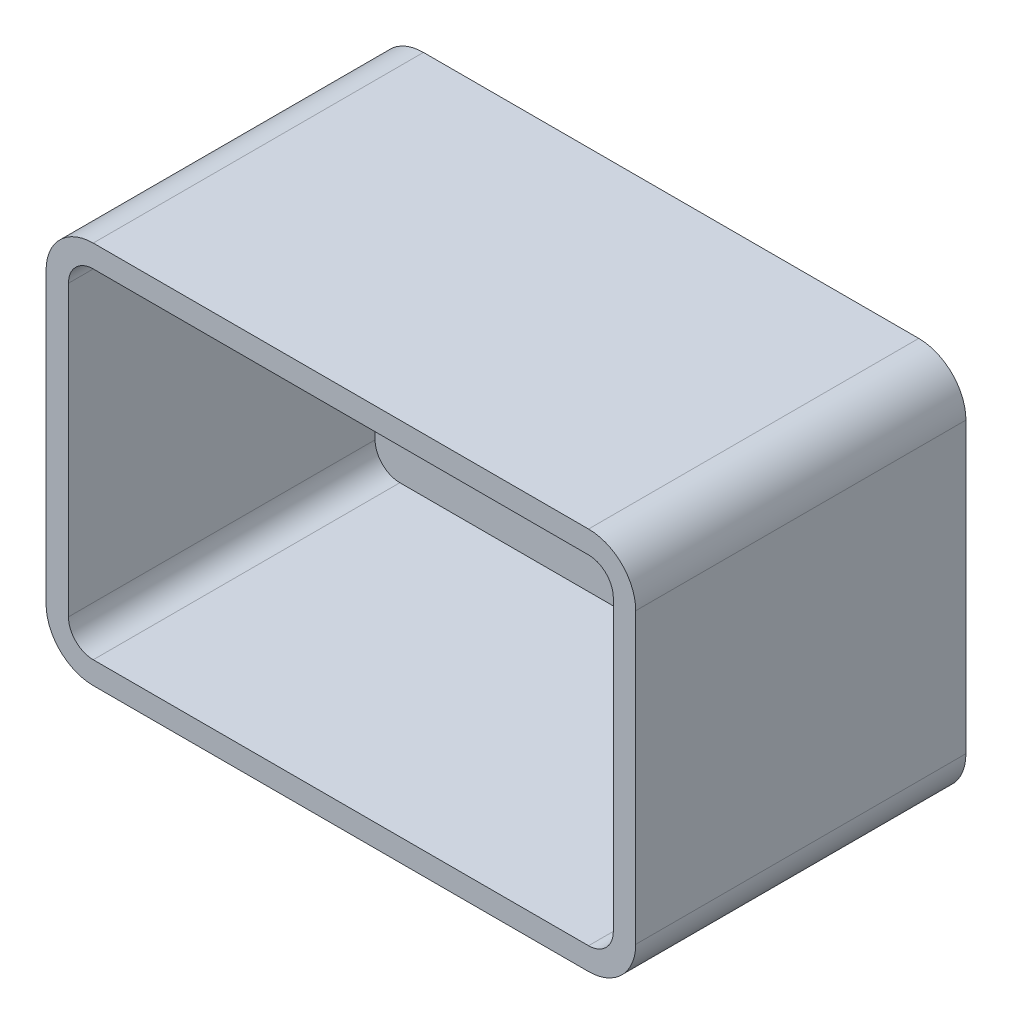
ISO-10303-21;
HEADER;
FILE_DESCRIPTION(('STEP AP214'),'2;1');
FILE_NAME('part.step','',(''),(''),'','','');
FILE_SCHEMA(('AUTOMOTIVE_DESIGN { 1 0 10303 214 1 1 1 1 }'));
ENDSEC;
DATA;
#1=APPLICATION_CONTEXT('core data for automotive mechanical design processes');
#2=APPLICATION_PROTOCOL_DEFINITION('international standard','automotive_design',2000,#1);
#3=PRODUCT_CONTEXT('',#1,'mechanical');
#4=PRODUCT('Part','Part','',(#3));
#5=PRODUCT_RELATED_PRODUCT_CATEGORY('part','',(#4));
#6=PRODUCT_DEFINITION_FORMATION('','',#4);
#7=PRODUCT_DEFINITION_CONTEXT('part definition',#1,'design');
#8=PRODUCT_DEFINITION('design','',#6,#7);
#9=PRODUCT_DEFINITION_SHAPE('','',#8);
#10=(LENGTH_UNIT() NAMED_UNIT(*) SI_UNIT(.MILLI.,.METRE.));
#11=(NAMED_UNIT(*) PLANE_ANGLE_UNIT() SI_UNIT($,.RADIAN.));
#12=(NAMED_UNIT(*) SI_UNIT($,.STERADIAN.) SOLID_ANGLE_UNIT());
#13=UNCERTAINTY_MEASURE_WITH_UNIT(LENGTH_MEASURE(1.E-05),#10,'distance_accuracy_value','');
#14=(GEOMETRIC_REPRESENTATION_CONTEXT(3) GLOBAL_UNCERTAINTY_ASSIGNED_CONTEXT((#13)) GLOBAL_UNIT_ASSIGNED_CONTEXT((#10,
#11,#12)) REPRESENTATION_CONTEXT('',''));
#15=CARTESIAN_POINT('',(0.,0.,0.));
#16=DIRECTION('',(0.,0.,1.));
#17=DIRECTION('',(1.,0.,0.));
#18=AXIS2_PLACEMENT_3D('',#15,#16,#17);
#19=CARTESIAN_POINT('',(-23.1,0.,28.));
#20=DIRECTION('',(-1.,0.,0.));
#21=DIRECTION('',(0.,0.,1.));
#22=AXIS2_PLACEMENT_3D('',#19,#20,#21);
#23=PLANE('',#22);
#24=DIRECTION('',(0.,0.,-1.));
#25=VECTOR('',#24,1.);
#26=CARTESIAN_POINT('',(-23.1,-12.25,28.));
#27=LINE('',#26,#25);
#28=CARTESIAN_POINT('',(-23.1,-12.25,28.));
#29=VERTEX_POINT('',#28);
#30=CARTESIAN_POINT('',(-23.1,-12.25,2.));
#31=VERTEX_POINT('',#30);
#32=EDGE_CURVE('E212',#29,#31,#27,.T.);
#33=ORIENTED_EDGE('',*,*,#32,.T.);
#34=DIRECTION('',(0.,1.,0.));
#35=VECTOR('',#34,1.);
#36=CARTESIAN_POINT('',(-23.1,0.,2.));
#37=LINE('',#36,#35);
#38=CARTESIAN_POINT('',(-23.1,12.25,2.));
#39=VERTEX_POINT('',#38);
#40=EDGE_CURVE('E58',#31,#39,#37,.T.);
#41=ORIENTED_EDGE('',*,*,#40,.T.);
#42=DIRECTION('',(0.,0.,-1.));
#43=VECTOR('',#42,1.);
#44=CARTESIAN_POINT('',(-23.1,12.25,28.));
#45=LINE('',#44,#43);
#46=CARTESIAN_POINT('',(-23.1,12.25,28.));
#47=VERTEX_POINT('',#46);
#48=EDGE_CURVE('E11',#47,#39,#45,.T.);
#49=ORIENTED_EDGE('',*,*,#48,.F.);
#50=DIRECTION('',(0.,1.,0.));
#51=VECTOR('',#50,1.);
#52=CARTESIAN_POINT('',(-23.1,0.,28.));
#53=LINE('',#52,#51);
#54=EDGE_CURVE('E302',#29,#47,#53,.T.);
#55=ORIENTED_EDGE('',*,*,#54,.F.);
#56=EDGE_LOOP('',(#33,#41,#49,#55));
#57=FACE_BOUND('',#56,.T.);
#58=ADVANCED_FACE('F40',(#57),#23,.F.);
#59=CARTESIAN_POINT('',(-21.,12.25,28.));
#60=DIRECTION('',(0.,0.,-1.));
#61=DIRECTION('',(-1.,0.,0.));
#62=AXIS2_PLACEMENT_3D('',#59,#60,#61);
#63=CYLINDRICAL_SURFACE('',#62,2.1);
#64=ORIENTED_EDGE('',*,*,#48,.T.);
#65=CARTESIAN_POINT('',(-21.,12.25,2.));
#66=DIRECTION('',(0.,0.,1.));
#67=DIRECTION('',(1.,0.,0.));
#68=AXIS2_PLACEMENT_3D('',#65,#66,#67);
#69=CIRCLE('',#68,2.1);
#70=CARTESIAN_POINT('',(-21.,14.35,2.));
#71=VERTEX_POINT('',#70);
#72=EDGE_CURVE('E389',#39,#71,#69,.F.);
#73=ORIENTED_EDGE('',*,*,#72,.T.);
#74=DIRECTION('',(0.,0.,-1.));
#75=VECTOR('',#74,1.);
#76=CARTESIAN_POINT('',(-21.,14.35,28.));
#77=LINE('',#76,#75);
#78=CARTESIAN_POINT('',(-21.,14.35,28.));
#79=VERTEX_POINT('',#78);
#80=EDGE_CURVE('E50',#79,#71,#77,.T.);
#81=ORIENTED_EDGE('',*,*,#80,.F.);
#82=CARTESIAN_POINT('',(-21.,12.25,28.));
#83=DIRECTION('',(0.,0.,1.));
#84=DIRECTION('',(1.,0.,0.));
#85=AXIS2_PLACEMENT_3D('',#82,#83,#84);
#86=CIRCLE('',#85,2.1);
#87=EDGE_CURVE('E305',#47,#79,#86,.F.);
#88=ORIENTED_EDGE('',*,*,#87,.F.);
#89=EDGE_LOOP('',(#64,#73,#81,#88));
#90=FACE_BOUND('',#89,.T.);
#91=ADVANCED_FACE('F407',(#90),#63,.F.);
#92=CARTESIAN_POINT('',(0.,14.35,28.));
#93=DIRECTION('',(0.,1.,0.));
#94=DIRECTION('',(0.,0.,1.));
#95=AXIS2_PLACEMENT_3D('',#92,#93,#94);
#96=PLANE('',#95);
#97=ORIENTED_EDGE('',*,*,#80,.T.);
#98=DIRECTION('',(1.,0.,0.));
#99=VECTOR('',#98,1.);
#100=CARTESIAN_POINT('',(0.,14.35,2.));
#101=LINE('',#100,#99);
#102=CARTESIAN_POINT('',(21.,14.35,2.));
#103=VERTEX_POINT('',#102);
#104=EDGE_CURVE('E412',#71,#103,#101,.T.);
#105=ORIENTED_EDGE('',*,*,#104,.T.);
#106=DIRECTION('',(0.,0.,-1.));
#107=VECTOR('',#106,1.);
#108=CARTESIAN_POINT('',(21.,14.35,28.));
#109=LINE('',#108,#107);
#110=CARTESIAN_POINT('',(21.,14.35,28.));
#111=VERTEX_POINT('',#110);
#112=EDGE_CURVE('E224',#111,#103,#109,.T.);
#113=ORIENTED_EDGE('',*,*,#112,.F.);
#114=DIRECTION('',(1.,0.,0.));
#115=VECTOR('',#114,1.);
#116=CARTESIAN_POINT('',(0.,14.35,28.));
#117=LINE('',#116,#115);
#118=EDGE_CURVE('E308',#79,#111,#117,.T.);
#119=ORIENTED_EDGE('',*,*,#118,.F.);
#120=EDGE_LOOP('',(#97,#105,#113,#119));
#121=FACE_BOUND('',#120,.T.);
#122=ADVANCED_FACE('F410',(#121),#96,.F.);
#123=CARTESIAN_POINT('',(21.,12.25,28.));
#124=DIRECTION('',(0.,0.,-1.));
#125=DIRECTION('',(-1.,0.,0.));
#126=AXIS2_PLACEMENT_3D('',#123,#124,#125);
#127=CYLINDRICAL_SURFACE('',#126,2.1);
#128=ORIENTED_EDGE('',*,*,#112,.T.);
#129=CARTESIAN_POINT('',(21.,12.25,2.));
#130=DIRECTION('',(0.,0.,1.));
#131=DIRECTION('',(1.,0.,0.));
#132=AXIS2_PLACEMENT_3D('',#129,#130,#131);
#133=CIRCLE('',#132,2.1);
#134=CARTESIAN_POINT('',(23.1,12.25,2.));
#135=VERTEX_POINT('',#134);
#136=EDGE_CURVE('E416',#103,#135,#133,.F.);
#137=ORIENTED_EDGE('',*,*,#136,.T.);
#138=DIRECTION('',(0.,0.,-1.));
#139=VECTOR('',#138,1.);
#140=CARTESIAN_POINT('',(23.1,12.25,28.));
#141=LINE('',#140,#139);
#142=CARTESIAN_POINT('',(23.1,12.25,28.));
#143=VERTEX_POINT('',#142);
#144=EDGE_CURVE('E220',#143,#135,#141,.T.);
#145=ORIENTED_EDGE('',*,*,#144,.F.);
#146=CARTESIAN_POINT('',(21.,12.25,28.));
#147=DIRECTION('',(0.,0.,1.));
#148=DIRECTION('',(1.,0.,0.));
#149=AXIS2_PLACEMENT_3D('',#146,#147,#148);
#150=CIRCLE('',#149,2.1);
#151=EDGE_CURVE('E311',#111,#143,#150,.F.);
#152=ORIENTED_EDGE('',*,*,#151,.F.);
#153=EDGE_LOOP('',(#128,#137,#145,#152));
#154=FACE_BOUND('',#153,.T.);
#155=ADVANCED_FACE('F415',(#154),#127,.F.);
#156=CARTESIAN_POINT('',(23.1,0.,28.));
#157=DIRECTION('',(-1.,0.,0.));
#158=DIRECTION('',(0.,0.,1.));
#159=AXIS2_PLACEMENT_3D('',#156,#157,#158);
#160=PLANE('',#159);
#161=DIRECTION('',(0.,1.,0.));
#162=VECTOR('',#161,1.);
#163=CARTESIAN_POINT('',(23.1,0.,2.));
#164=LINE('',#163,#162);
#165=CARTESIAN_POINT('',(23.1,-12.25,2.));
#166=VERTEX_POINT('',#165);
#167=EDGE_CURVE('E322',#166,#135,#164,.T.);
#168=ORIENTED_EDGE('',*,*,#167,.F.);
#169=DIRECTION('',(0.,0.,-1.));
#170=VECTOR('',#169,1.);
#171=CARTESIAN_POINT('',(23.1,-12.25,28.));
#172=LINE('',#171,#170);
#173=CARTESIAN_POINT('',(23.1,-12.25,28.));
#174=VERTEX_POINT('',#173);
#175=EDGE_CURVE('E162',#174,#166,#172,.T.);
#176=ORIENTED_EDGE('',*,*,#175,.F.);
#177=DIRECTION('',(0.,1.,0.));
#178=VECTOR('',#177,1.);
#179=CARTESIAN_POINT('',(23.1,0.,28.));
#180=LINE('',#179,#178);
#181=EDGE_CURVE('E169',#174,#143,#180,.T.);
#182=ORIENTED_EDGE('',*,*,#181,.T.);
#183=ORIENTED_EDGE('',*,*,#144,.T.);
#184=EDGE_LOOP('',(#168,#176,#182,#183));
#185=FACE_BOUND('',#184,.T.);
#186=ADVANCED_FACE('F317',(#185),#160,.T.);
#187=CARTESIAN_POINT('',(21.,-12.25,28.));
#188=DIRECTION('',(0.,0.,-1.));
#189=DIRECTION('',(-1.,0.,0.));
#190=AXIS2_PLACEMENT_3D('',#187,#188,#189);
#191=CYLINDRICAL_SURFACE('',#190,2.1);
#192=CARTESIAN_POINT('',(21.,-12.25,2.));
#193=DIRECTION('',(0.,0.,1.));
#194=DIRECTION('',(1.,0.,0.));
#195=AXIS2_PLACEMENT_3D('',#192,#193,#194);
#196=CIRCLE('',#195,2.1);
#197=CARTESIAN_POINT('',(21.,-14.35,2.));
#198=VERTEX_POINT('',#197);
#199=EDGE_CURVE('E157',#198,#166,#196,.T.);
#200=ORIENTED_EDGE('',*,*,#199,.F.);
#201=DIRECTION('',(0.,0.,-1.));
#202=VECTOR('',#201,1.);
#203=CARTESIAN_POINT('',(21.,-14.35,28.));
#204=LINE('',#203,#202);
#205=CARTESIAN_POINT('',(21.,-14.35,28.));
#206=VERTEX_POINT('',#205);
#207=EDGE_CURVE('E150',#206,#198,#204,.T.);
#208=ORIENTED_EDGE('',*,*,#207,.F.);
#209=CARTESIAN_POINT('',(21.,-12.25,28.));
#210=DIRECTION('',(0.,0.,1.));
#211=DIRECTION('',(1.,0.,0.));
#212=AXIS2_PLACEMENT_3D('',#209,#210,#211);
#213=CIRCLE('',#212,2.1);
#214=EDGE_CURVE('E154',#206,#174,#213,.T.);
#215=ORIENTED_EDGE('',*,*,#214,.T.);
#216=ORIENTED_EDGE('',*,*,#175,.T.);
#217=EDGE_LOOP('',(#200,#208,#215,#216));
#218=FACE_BOUND('',#217,.T.);
#219=ADVANCED_FACE('F152',(#218),#191,.F.);
#220=CARTESIAN_POINT('',(0.,-14.35,28.));
#221=DIRECTION('',(0.,1.,0.));
#222=DIRECTION('',(-1.,0.,0.));
#223=AXIS2_PLACEMENT_3D('',#220,#221,#222);
#224=PLANE('',#223);
#225=DIRECTION('',(1.,0.,0.));
#226=VECTOR('',#225,1.);
#227=CARTESIAN_POINT('',(0.,-14.35,2.));
#228=LINE('',#227,#226);
#229=CARTESIAN_POINT('',(-21.,-14.35,2.));
#230=VERTEX_POINT('',#229);
#231=EDGE_CURVE('E393',#230,#198,#228,.T.);
#232=ORIENTED_EDGE('',*,*,#231,.F.);
#233=DIRECTION('',(0.,0.,-1.));
#234=VECTOR('',#233,1.);
#235=CARTESIAN_POINT('',(-21.,-14.35,28.));
#236=LINE('',#235,#234);
#237=CARTESIAN_POINT('',(-21.,-14.35,28.));
#238=VERTEX_POINT('',#237);
#239=EDGE_CURVE('E163',#238,#230,#236,.T.);
#240=ORIENTED_EDGE('',*,*,#239,.F.);
#241=DIRECTION('',(1.,0.,0.));
#242=VECTOR('',#241,1.);
#243=CARTESIAN_POINT('',(0.,-14.35,28.));
#244=LINE('',#243,#242);
#245=EDGE_CURVE('E167',#238,#206,#244,.T.);
#246=ORIENTED_EDGE('',*,*,#245,.T.);
#247=ORIENTED_EDGE('',*,*,#207,.T.);
#248=EDGE_LOOP('',(#232,#240,#246,#247));
#249=FACE_BOUND('',#248,.T.);
#250=ADVANCED_FACE('F172',(#249),#224,.T.);
#251=CARTESIAN_POINT('',(-21.,12.25,28.));
#252=DIRECTION('',(0.,0.,-1.));
#253=DIRECTION('',(-1.,0.,0.));
#254=AXIS2_PLACEMENT_3D('',#251,#252,#253);
#255=CYLINDRICAL_SURFACE('',#254,4.);
#256=CARTESIAN_POINT('',(-21.,12.25,0.));
#257=DIRECTION('',(0.,0.,1.));
#258=DIRECTION('',(1.,0.,0.));
#259=AXIS2_PLACEMENT_3D('',#256,#257,#258);
#260=CIRCLE('',#259,4.);
#261=CARTESIAN_POINT('',(-25.,12.25,0.));
#262=VERTEX_POINT('',#261);
#263=CARTESIAN_POINT('',(-21.,16.25,0.));
#264=VERTEX_POINT('',#263);
#265=EDGE_CURVE('E181',#262,#264,#260,.F.);
#266=ORIENTED_EDGE('',*,*,#265,.F.);
#267=DIRECTION('',(0.,0.,-1.));
#268=VECTOR('',#267,1.);
#269=CARTESIAN_POINT('',(-25.,12.25,28.));
#270=LINE('',#269,#268);
#271=CARTESIAN_POINT('',(-25.,12.25,28.));
#272=VERTEX_POINT('',#271);
#273=EDGE_CURVE('E44',#272,#262,#270,.T.);
#274=ORIENTED_EDGE('',*,*,#273,.F.);
#275=CARTESIAN_POINT('',(-21.,12.25,28.));
#276=DIRECTION('',(0.,0.,1.));
#277=DIRECTION('',(1.,0.,0.));
#278=AXIS2_PLACEMENT_3D('',#275,#276,#277);
#279=CIRCLE('',#278,4.);
#280=CARTESIAN_POINT('',(-21.,16.25,28.));
#281=VERTEX_POINT('',#280);
#282=EDGE_CURVE('E211',#272,#281,#279,.F.);
#283=ORIENTED_EDGE('',*,*,#282,.T.);
#284=DIRECTION('',(0.,0.,-1.));
#285=VECTOR('',#284,1.);
#286=CARTESIAN_POINT('',(-21.,16.25,28.));
#287=LINE('',#286,#285);
#288=EDGE_CURVE('E102',#281,#264,#287,.T.);
#289=ORIENTED_EDGE('',*,*,#288,.T.);
#290=EDGE_LOOP('',(#266,#274,#283,#289));
#291=FACE_BOUND('',#290,.T.);
#292=ADVANCED_FACE('F42',(#291),#255,.T.);
#293=CARTESIAN_POINT('',(-25.,0.,28.));
#294=DIRECTION('',(-1.,0.,0.));
#295=DIRECTION('',(0.,0.,1.));
#296=AXIS2_PLACEMENT_3D('',#293,#294,#295);
#297=PLANE('',#296);
#298=DIRECTION('',(0.,1.,0.));
#299=VECTOR('',#298,1.);
#300=CARTESIAN_POINT('',(-25.,0.,0.));
#301=LINE('',#300,#299);
#302=CARTESIAN_POINT('',(-25.,-12.25,0.));
#303=VERTEX_POINT('',#302);
#304=EDGE_CURVE('E184',#303,#262,#301,.T.);
#305=ORIENTED_EDGE('',*,*,#304,.F.);
#306=DIRECTION('',(0.,0.,-1.));
#307=VECTOR('',#306,1.);
#308=CARTESIAN_POINT('',(-25.,-12.25,28.));
#309=LINE('',#308,#307);
#310=CARTESIAN_POINT('',(-25.,-12.25,28.));
#311=VERTEX_POINT('',#310);
#312=EDGE_CURVE('E249',#311,#303,#309,.T.);
#313=ORIENTED_EDGE('',*,*,#312,.F.);
#314=DIRECTION('',(0.,1.,0.));
#315=VECTOR('',#314,1.);
#316=CARTESIAN_POINT('',(-25.,0.,28.));
#317=LINE('',#316,#315);
#318=EDGE_CURVE('E262',#311,#272,#317,.T.);
#319=ORIENTED_EDGE('',*,*,#318,.T.);
#320=ORIENTED_EDGE('',*,*,#273,.T.);
#321=EDGE_LOOP('',(#305,#313,#319,#320));
#322=FACE_BOUND('',#321,.T.);
#323=ADVANCED_FACE('F260',(#322),#297,.T.);
#324=CARTESIAN_POINT('',(-21.,-12.25,28.));
#325=DIRECTION('',(0.,0.,-1.));
#326=DIRECTION('',(-1.,0.,0.));
#327=AXIS2_PLACEMENT_3D('',#324,#325,#326);
#328=CYLINDRICAL_SURFACE('',#327,4.);
#329=CARTESIAN_POINT('',(-21.,-12.25,0.));
#330=DIRECTION('',(0.,0.,1.));
#331=DIRECTION('',(1.,0.,0.));
#332=AXIS2_PLACEMENT_3D('',#329,#330,#331);
#333=CIRCLE('',#332,4.);
#334=CARTESIAN_POINT('',(-21.,-16.25,0.));
#335=VERTEX_POINT('',#334);
#336=EDGE_CURVE('E189',#335,#303,#333,.F.);
#337=ORIENTED_EDGE('',*,*,#336,.F.);
#338=DIRECTION('',(0.,0.,-1.));
#339=VECTOR('',#338,1.);
#340=CARTESIAN_POINT('',(-21.,-16.25,28.));
#341=LINE('',#340,#339);
#342=CARTESIAN_POINT('',(-21.,-16.25,28.));
#343=VERTEX_POINT('',#342);
#344=EDGE_CURVE('E247',#343,#335,#341,.T.);
#345=ORIENTED_EDGE('',*,*,#344,.F.);
#346=CARTESIAN_POINT('',(-21.,-12.25,28.));
#347=DIRECTION('',(0.,0.,1.));
#348=DIRECTION('',(1.,0.,0.));
#349=AXIS2_PLACEMENT_3D('',#346,#347,#348);
#350=CIRCLE('',#349,4.);
#351=EDGE_CURVE('E272',#343,#311,#350,.F.);
#352=ORIENTED_EDGE('',*,*,#351,.T.);
#353=ORIENTED_EDGE('',*,*,#312,.T.);
#354=EDGE_LOOP('',(#337,#345,#352,#353));
#355=FACE_BOUND('',#354,.T.);
#356=ADVANCED_FACE('F269',(#355),#328,.T.);
#357=CARTESIAN_POINT('',(0.,-16.25,28.));
#358=DIRECTION('',(0.,1.,0.));
#359=DIRECTION('',(0.,0.,1.));
#360=AXIS2_PLACEMENT_3D('',#357,#358,#359);
#361=PLANE('',#360);
#362=DIRECTION('',(1.,0.,0.));
#363=VECTOR('',#362,1.);
#364=CARTESIAN_POINT('',(0.,-16.25,0.));
#365=LINE('',#364,#363);
#366=CARTESIAN_POINT('',(21.,-16.25,0.));
#367=VERTEX_POINT('',#366);
#368=EDGE_CURVE('E193',#335,#367,#365,.T.);
#369=ORIENTED_EDGE('',*,*,#368,.T.);
#370=DIRECTION('',(0.,0.,-1.));
#371=VECTOR('',#370,1.);
#372=CARTESIAN_POINT('',(21.,-16.25,28.));
#373=LINE('',#372,#371);
#374=CARTESIAN_POINT('',(21.,-16.25,28.));
#375=VERTEX_POINT('',#374);
#376=EDGE_CURVE('E243',#375,#367,#373,.T.);
#377=ORIENTED_EDGE('',*,*,#376,.F.);
#378=DIRECTION('',(1.,0.,0.));
#379=VECTOR('',#378,1.);
#380=CARTESIAN_POINT('',(0.,-16.25,28.));
#381=LINE('',#380,#379);
#382=EDGE_CURVE('E275',#343,#375,#381,.T.);
#383=ORIENTED_EDGE('',*,*,#382,.F.);
#384=ORIENTED_EDGE('',*,*,#344,.T.);
#385=EDGE_LOOP('',(#369,#377,#383,#384));
#386=FACE_BOUND('',#385,.T.);
#387=ADVANCED_FACE('F276',(#386),#361,.F.);
#388=CARTESIAN_POINT('',(21.,-12.25,28.));
#389=DIRECTION('',(0.,0.,-1.));
#390=DIRECTION('',(-1.,0.,0.));
#391=AXIS2_PLACEMENT_3D('',#388,#389,#390);
#392=CYLINDRICAL_SURFACE('',#391,4.);
#393=CARTESIAN_POINT('',(21.,-12.25,0.));
#394=DIRECTION('',(0.,0.,1.));
#395=DIRECTION('',(1.,0.,0.));
#396=AXIS2_PLACEMENT_3D('',#393,#394,#395);
#397=CIRCLE('',#396,4.);
#398=CARTESIAN_POINT('',(25.,-12.25,0.));
#399=VERTEX_POINT('',#398);
#400=EDGE_CURVE('E196',#367,#399,#397,.T.);
#401=ORIENTED_EDGE('',*,*,#400,.T.);
#402=DIRECTION('',(0.,0.,-1.));
#403=VECTOR('',#402,1.);
#404=CARTESIAN_POINT('',(25.,-12.25,28.));
#405=LINE('',#404,#403);
#406=CARTESIAN_POINT('',(25.,-12.25,28.));
#407=VERTEX_POINT('',#406);
#408=EDGE_CURVE('E239',#407,#399,#405,.T.);
#409=ORIENTED_EDGE('',*,*,#408,.F.);
#410=CARTESIAN_POINT('',(21.,-12.25,28.));
#411=DIRECTION('',(0.,0.,1.));
#412=DIRECTION('',(1.,0.,0.));
#413=AXIS2_PLACEMENT_3D('',#410,#411,#412);
#414=CIRCLE('',#413,4.);
#415=EDGE_CURVE('E280',#375,#407,#414,.T.);
#416=ORIENTED_EDGE('',*,*,#415,.F.);
#417=ORIENTED_EDGE('',*,*,#376,.T.);
#418=EDGE_LOOP('',(#401,#409,#416,#417));
#419=FACE_BOUND('',#418,.T.);
#420=ADVANCED_FACE('F522',(#419),#392,.T.);
#421=CARTESIAN_POINT('',(25.,0.,28.));
#422=DIRECTION('',(-1.,0.,0.));
#423=DIRECTION('',(0.,0.,1.));
#424=AXIS2_PLACEMENT_3D('',#421,#422,#423);
#425=PLANE('',#424);
#426=DIRECTION('',(0.,1.,0.));
#427=VECTOR('',#426,1.);
#428=CARTESIAN_POINT('',(25.,0.,0.));
#429=LINE('',#428,#427);
#430=CARTESIAN_POINT('',(25.,12.25,0.));
#431=VERTEX_POINT('',#430);
#432=EDGE_CURVE('E199',#399,#431,#429,.T.);
#433=ORIENTED_EDGE('',*,*,#432,.T.);
#434=DIRECTION('',(0.,0.,-1.));
#435=VECTOR('',#434,1.);
#436=CARTESIAN_POINT('',(25.,12.25,28.));
#437=LINE('',#436,#435);
#438=CARTESIAN_POINT('',(25.,12.25,28.));
#439=VERTEX_POINT('',#438);
#440=EDGE_CURVE('E236',#439,#431,#437,.T.);
#441=ORIENTED_EDGE('',*,*,#440,.F.);
#442=DIRECTION('',(0.,1.,0.));
#443=VECTOR('',#442,1.);
#444=CARTESIAN_POINT('',(25.,0.,28.));
#445=LINE('',#444,#443);
#446=EDGE_CURVE('E291',#407,#439,#445,.T.);
#447=ORIENTED_EDGE('',*,*,#446,.F.);
#448=ORIENTED_EDGE('',*,*,#408,.T.);
#449=EDGE_LOOP('',(#433,#441,#447,#448));
#450=FACE_BOUND('',#449,.T.);
#451=ADVANCED_FACE('F519',(#450),#425,.F.);
#452=CARTESIAN_POINT('',(21.,12.25,28.));
#453=DIRECTION('',(0.,0.,-1.));
#454=DIRECTION('',(-1.,0.,0.));
#455=AXIS2_PLACEMENT_3D('',#452,#453,#454);
#456=CYLINDRICAL_SURFACE('',#455,4.);
#457=CARTESIAN_POINT('',(21.,12.25,0.));
#458=DIRECTION('',(0.,0.,1.));
#459=DIRECTION('',(1.,0.,0.));
#460=AXIS2_PLACEMENT_3D('',#457,#458,#459);
#461=CIRCLE('',#460,4.);
#462=CARTESIAN_POINT('',(21.,16.25,0.));
#463=VERTEX_POINT('',#462);
#464=EDGE_CURVE('E203',#463,#431,#461,.F.);
#465=ORIENTED_EDGE('',*,*,#464,.F.);
#466=DIRECTION('',(0.,0.,-1.));
#467=VECTOR('',#466,1.);
#468=CARTESIAN_POINT('',(21.,16.25,28.));
#469=LINE('',#468,#467);
#470=CARTESIAN_POINT('',(21.,16.25,28.));
#471=VERTEX_POINT('',#470);
#472=EDGE_CURVE('E233',#471,#463,#469,.T.);
#473=ORIENTED_EDGE('',*,*,#472,.F.);
#474=CARTESIAN_POINT('',(21.,12.25,28.));
#475=DIRECTION('',(0.,0.,1.));
#476=DIRECTION('',(1.,0.,0.));
#477=AXIS2_PLACEMENT_3D('',#474,#475,#476);
#478=CIRCLE('',#477,4.);
#479=EDGE_CURVE('E294',#471,#439,#478,.F.);
#480=ORIENTED_EDGE('',*,*,#479,.T.);
#481=ORIENTED_EDGE('',*,*,#440,.T.);
#482=EDGE_LOOP('',(#465,#473,#480,#481));
#483=FACE_BOUND('',#482,.T.);
#484=ADVANCED_FACE('F515',(#483),#456,.T.);
#485=CARTESIAN_POINT('',(0.,16.25,28.));
#486=DIRECTION('',(0.,1.,0.));
#487=DIRECTION('',(0.,0.,1.));
#488=AXIS2_PLACEMENT_3D('',#485,#486,#487);
#489=PLANE('',#488);
#490=DIRECTION('',(1.,0.,0.));
#491=VECTOR('',#490,1.);
#492=CARTESIAN_POINT('',(0.,16.25,0.));
#493=LINE('',#492,#491);
#494=EDGE_CURVE('E207',#264,#463,#493,.T.);
#495=ORIENTED_EDGE('',*,*,#494,.F.);
#496=ORIENTED_EDGE('',*,*,#288,.F.);
#497=DIRECTION('',(1.,0.,0.));
#498=VECTOR('',#497,1.);
#499=CARTESIAN_POINT('',(0.,16.25,28.));
#500=LINE('',#499,#498);
#501=EDGE_CURVE('E298',#281,#471,#500,.T.);
#502=ORIENTED_EDGE('',*,*,#501,.T.);
#503=ORIENTED_EDGE('',*,*,#472,.T.);
#504=EDGE_LOOP('',(#495,#496,#502,#503));
#505=FACE_BOUND('',#504,.T.);
#506=ADVANCED_FACE('F511',(#505),#489,.T.);
#507=CARTESIAN_POINT('',(-21.,-12.25,28.));
#508=DIRECTION('',(0.,0.,-1.));
#509=DIRECTION('',(-1.,0.,0.));
#510=AXIS2_PLACEMENT_3D('',#507,#508,#509);
#511=CYLINDRICAL_SURFACE('',#510,2.1);
#512=ORIENTED_EDGE('',*,*,#239,.T.);
#513=CARTESIAN_POINT('',(-21.,-12.25,2.));
#514=DIRECTION('',(0.,0.,1.));
#515=DIRECTION('',(1.,0.,0.));
#516=AXIS2_PLACEMENT_3D('',#513,#514,#515);
#517=CIRCLE('',#516,2.1);
#518=EDGE_CURVE('E390',#230,#31,#517,.F.);
#519=ORIENTED_EDGE('',*,*,#518,.T.);
#520=ORIENTED_EDGE('',*,*,#32,.F.);
#521=CARTESIAN_POINT('',(-21.,-12.25,28.));
#522=DIRECTION('',(0.,0.,1.));
#523=DIRECTION('',(1.,0.,0.));
#524=AXIS2_PLACEMENT_3D('',#521,#522,#523);
#525=CIRCLE('',#524,2.1);
#526=EDGE_CURVE('E67',#238,#29,#525,.F.);
#527=ORIENTED_EDGE('',*,*,#526,.F.);
#528=EDGE_LOOP('',(#512,#519,#520,#527));
#529=FACE_BOUND('',#528,.T.);
#530=ADVANCED_FACE('F399',(#529),#511,.F.);
#531=CARTESIAN_POINT('',(0.,0.,28.));
#532=DIRECTION('',(0.,0.,1.));
#533=DIRECTION('',(1.,0.,0.));
#534=AXIS2_PLACEMENT_3D('',#531,#532,#533);
#535=PLANE('',#534);
#536=ORIENTED_EDGE('',*,*,#282,.F.);
#537=ORIENTED_EDGE('',*,*,#318,.F.);
#538=ORIENTED_EDGE('',*,*,#351,.F.);
#539=ORIENTED_EDGE('',*,*,#382,.T.);
#540=ORIENTED_EDGE('',*,*,#415,.T.);
#541=ORIENTED_EDGE('',*,*,#446,.T.);
#542=ORIENTED_EDGE('',*,*,#479,.F.);
#543=ORIENTED_EDGE('',*,*,#501,.F.);
#544=EDGE_LOOP('',(#536,#537,#538,#539,#540,#541,#542,#543));
#545=FACE_BOUND('',#544,.T.);
#546=ORIENTED_EDGE('',*,*,#54,.T.);
#547=ORIENTED_EDGE('',*,*,#87,.T.);
#548=ORIENTED_EDGE('',*,*,#118,.T.);
#549=ORIENTED_EDGE('',*,*,#151,.T.);
#550=ORIENTED_EDGE('',*,*,#181,.F.);
#551=ORIENTED_EDGE('',*,*,#214,.F.);
#552=ORIENTED_EDGE('',*,*,#245,.F.);
#553=ORIENTED_EDGE('',*,*,#526,.T.);
#554=EDGE_LOOP('',(#546,#547,#548,#549,#550,#551,#552,#553));
#555=FACE_BOUND('',#554,.T.);
#556=ADVANCED_FACE('F166',(#545,#555),#535,.T.);
#557=CARTESIAN_POINT('',(0.,0.,0.));
#558=DIRECTION('',(0.,0.,1.));
#559=DIRECTION('',(1.,0.,0.));
#560=AXIS2_PLACEMENT_3D('',#557,#558,#559);
#561=PLANE('',#560);
#562=ORIENTED_EDGE('',*,*,#265,.T.);
#563=ORIENTED_EDGE('',*,*,#494,.T.);
#564=ORIENTED_EDGE('',*,*,#464,.T.);
#565=ORIENTED_EDGE('',*,*,#432,.F.);
#566=ORIENTED_EDGE('',*,*,#400,.F.);
#567=ORIENTED_EDGE('',*,*,#368,.F.);
#568=ORIENTED_EDGE('',*,*,#336,.T.);
#569=ORIENTED_EDGE('',*,*,#304,.T.);
#570=EDGE_LOOP('',(#562,#563,#564,#565,#566,#567,#568,#569));
#571=FACE_BOUND('',#570,.T.);
#572=DIRECTION('',(0.,1.,0.));
#573=VECTOR('',#572,1.);
#574=CARTESIAN_POINT('',(-20.5,0.,0.));
#575=LINE('',#574,#573);
#576=CARTESIAN_POINT('',(-20.5,-8.00000000000001,0.));
#577=VERTEX_POINT('',#576);
#578=CARTESIAN_POINT('',(-20.5,7.99999999999999,0.));
#579=VERTEX_POINT('',#578);
#580=EDGE_CURVE('E455',#577,#579,#575,.T.);
#581=ORIENTED_EDGE('',*,*,#580,.F.);
#582=CARTESIAN_POINT('',(-19.5,-8.00000000000001,0.));
#583=DIRECTION('',(0.,0.,1.));
#584=DIRECTION('',(1.,0.,0.));
#585=AXIS2_PLACEMENT_3D('',#582,#583,#584);
#586=CIRCLE('',#585,1.);
#587=CARTESIAN_POINT('',(-19.5,-9.00000000000001,0.));
#588=VERTEX_POINT('',#587);
#589=EDGE_CURVE('E385',#588,#577,#586,.F.);
#590=ORIENTED_EDGE('',*,*,#589,.F.);
#591=DIRECTION('',(1.,0.,0.));
#592=VECTOR('',#591,1.);
#593=CARTESIAN_POINT('',(0.,-9.00000000000001,0.));
#594=LINE('',#593,#592);
#595=CARTESIAN_POINT('',(-14.5,-9.00000000000001,0.));
#596=VERTEX_POINT('',#595);
#597=EDGE_CURVE('E477',#588,#596,#594,.T.);
#598=ORIENTED_EDGE('',*,*,#597,.T.);
#599=CARTESIAN_POINT('',(-14.5,-8.00000000000001,0.));
#600=DIRECTION('',(0.,0.,1.));
#601=DIRECTION('',(1.,0.,0.));
#602=AXIS2_PLACEMENT_3D('',#599,#600,#601);
#603=CIRCLE('',#602,1.);
#604=CARTESIAN_POINT('',(-13.5,-8.00000000000001,0.));
#605=VERTEX_POINT('',#604);
#606=EDGE_CURVE('E473',#596,#605,#603,.T.);
#607=ORIENTED_EDGE('',*,*,#606,.T.);
#608=DIRECTION('',(0.,1.,0.));
#609=VECTOR('',#608,1.);
#610=CARTESIAN_POINT('',(-13.5,0.,0.));
#611=LINE('',#610,#609);
#612=CARTESIAN_POINT('',(-13.5,7.99999999999999,0.));
#613=VERTEX_POINT('',#612);
#614=EDGE_CURVE('E469',#605,#613,#611,.T.);
#615=ORIENTED_EDGE('',*,*,#614,.T.);
#616=CARTESIAN_POINT('',(-14.5,7.99999999999999,0.));
#617=DIRECTION('',(0.,0.,1.));
#618=DIRECTION('',(1.,0.,0.));
#619=AXIS2_PLACEMENT_3D('',#616,#617,#618);
#620=CIRCLE('',#619,1.);
#621=CARTESIAN_POINT('',(-14.5,8.99999999999999,0.));
#622=VERTEX_POINT('',#621);
#623=EDGE_CURVE('E465',#622,#613,#620,.F.);
#624=ORIENTED_EDGE('',*,*,#623,.F.);
#625=DIRECTION('',(1.,0.,0.));
#626=VECTOR('',#625,1.);
#627=CARTESIAN_POINT('',(0.,9.,0.));
#628=LINE('',#627,#626);
#629=CARTESIAN_POINT('',(-19.5,8.99999999999999,0.));
#630=VERTEX_POINT('',#629);
#631=EDGE_CURVE('E462',#630,#622,#628,.T.);
#632=ORIENTED_EDGE('',*,*,#631,.F.);
#633=CARTESIAN_POINT('',(-19.5,7.99999999999999,0.));
#634=DIRECTION('',(0.,0.,1.));
#635=DIRECTION('',(1.,0.,0.));
#636=AXIS2_PLACEMENT_3D('',#633,#634,#635);
#637=CIRCLE('',#636,1.);
#638=EDGE_CURVE('E459',#579,#630,#637,.F.);
#639=ORIENTED_EDGE('',*,*,#638,.F.);
#640=EDGE_LOOP('',(#581,#590,#598,#607,#615,#624,#632,#639));
#641=FACE_BOUND('',#640,.T.);
#642=ADVANCED_FACE('F265',(#571,#641),#561,.F.);
#643=CARTESIAN_POINT('',(-20.5,0.,2.));
#644=DIRECTION('',(-1.,0.,0.));
#645=DIRECTION('',(0.,0.,1.));
#646=AXIS2_PLACEMENT_3D('',#643,#644,#645);
#647=PLANE('',#646);
#648=ORIENTED_EDGE('',*,*,#580,.T.);
#649=DIRECTION('',(0.,0.,-1.));
#650=VECTOR('',#649,1.);
#651=CARTESIAN_POINT('',(-20.5,7.99999999999999,2.));
#652=LINE('',#651,#650);
#653=CARTESIAN_POINT('',(-20.5,7.99999999999999,2.));
#654=VERTEX_POINT('',#653);
#655=EDGE_CURVE('E185',#654,#579,#652,.T.);
#656=ORIENTED_EDGE('',*,*,#655,.F.);
#657=DIRECTION('',(0.,1.,0.));
#658=VECTOR('',#657,1.);
#659=CARTESIAN_POINT('',(-20.5,0.,2.));
#660=LINE('',#659,#658);
#661=CARTESIAN_POINT('',(-20.5,-8.00000000000001,2.));
#662=VERTEX_POINT('',#661);
#663=EDGE_CURVE('E422',#662,#654,#660,.T.);
#664=ORIENTED_EDGE('',*,*,#663,.F.);
#665=DIRECTION('',(0.,0.,-1.));
#666=VECTOR('',#665,1.);
#667=CARTESIAN_POINT('',(-20.5,-8.00000000000001,2.));
#668=LINE('',#667,#666);
#669=EDGE_CURVE('E454',#662,#577,#668,.T.);
#670=ORIENTED_EDGE('',*,*,#669,.T.);
#671=EDGE_LOOP('',(#648,#656,#664,#670));
#672=FACE_BOUND('',#671,.T.);
#673=ADVANCED_FACE('F568',(#672),#647,.F.);
#674=CARTESIAN_POINT('',(-19.5,7.99999999999999,2.));
#675=DIRECTION('',(0.,0.,-1.));
#676=DIRECTION('',(-1.,0.,0.));
#677=AXIS2_PLACEMENT_3D('',#674,#675,#676);
#678=CYLINDRICAL_SURFACE('',#677,1.);
#679=ORIENTED_EDGE('',*,*,#638,.T.);
#680=DIRECTION('',(0.,0.,-1.));
#681=VECTOR('',#680,1.);
#682=CARTESIAN_POINT('',(-19.5,8.99999999999999,2.));
#683=LINE('',#682,#681);
#684=CARTESIAN_POINT('',(-19.5,8.99999999999999,2.));
#685=VERTEX_POINT('',#684);
#686=EDGE_CURVE('E500',#685,#630,#683,.T.);
#687=ORIENTED_EDGE('',*,*,#686,.F.);
#688=CARTESIAN_POINT('',(-19.5,7.99999999999999,2.));
#689=DIRECTION('',(0.,0.,1.));
#690=DIRECTION('',(1.,0.,0.));
#691=AXIS2_PLACEMENT_3D('',#688,#689,#690);
#692=CIRCLE('',#691,1.);
#693=EDGE_CURVE('E430',#654,#685,#692,.F.);
#694=ORIENTED_EDGE('',*,*,#693,.F.);
#695=ORIENTED_EDGE('',*,*,#655,.T.);
#696=EDGE_LOOP('',(#679,#687,#694,#695));
#697=FACE_BOUND('',#696,.T.);
#698=ADVANCED_FACE('F575',(#697),#678,.F.);
#699=CARTESIAN_POINT('',(0.,9.,2.));
#700=DIRECTION('',(0.,1.,0.));
#701=DIRECTION('',(-1.,0.,0.));
#702=AXIS2_PLACEMENT_3D('',#699,#700,#701);
#703=PLANE('',#702);
#704=ORIENTED_EDGE('',*,*,#631,.T.);
#705=DIRECTION('',(0.,0.,-1.));
#706=VECTOR('',#705,1.);
#707=CARTESIAN_POINT('',(-14.5,8.99999999999999,2.));
#708=LINE('',#707,#706);
#709=CARTESIAN_POINT('',(-14.5,8.99999999999999,2.));
#710=VERTEX_POINT('',#709);
#711=EDGE_CURVE('E496',#710,#622,#708,.T.);
#712=ORIENTED_EDGE('',*,*,#711,.F.);
#713=DIRECTION('',(1.,0.,0.));
#714=VECTOR('',#713,1.);
#715=CARTESIAN_POINT('',(0.,9.,2.));
#716=LINE('',#715,#714);
#717=EDGE_CURVE('E433',#685,#710,#716,.T.);
#718=ORIENTED_EDGE('',*,*,#717,.F.);
#719=ORIENTED_EDGE('',*,*,#686,.T.);
#720=EDGE_LOOP('',(#704,#712,#718,#719));
#721=FACE_BOUND('',#720,.T.);
#722=ADVANCED_FACE('F583',(#721),#703,.F.);
#723=CARTESIAN_POINT('',(-14.5,7.99999999999999,2.));
#724=DIRECTION('',(0.,0.,-1.));
#725=DIRECTION('',(-1.,0.,0.));
#726=AXIS2_PLACEMENT_3D('',#723,#724,#725);
#727=CYLINDRICAL_SURFACE('',#726,1.);
#728=ORIENTED_EDGE('',*,*,#623,.T.);
#729=DIRECTION('',(0.,0.,-1.));
#730=VECTOR('',#729,1.);
#731=CARTESIAN_POINT('',(-13.5,7.99999999999999,2.));
#732=LINE('',#731,#730);
#733=CARTESIAN_POINT('',(-13.5,7.99999999999999,2.));
#734=VERTEX_POINT('',#733);
#735=EDGE_CURVE('E493',#734,#613,#732,.T.);
#736=ORIENTED_EDGE('',*,*,#735,.F.);
#737=CARTESIAN_POINT('',(-14.5,7.99999999999999,2.));
#738=DIRECTION('',(0.,0.,1.));
#739=DIRECTION('',(1.,0.,0.));
#740=AXIS2_PLACEMENT_3D('',#737,#738,#739);
#741=CIRCLE('',#740,1.);
#742=EDGE_CURVE('E436',#710,#734,#741,.F.);
#743=ORIENTED_EDGE('',*,*,#742,.F.);
#744=ORIENTED_EDGE('',*,*,#711,.T.);
#745=EDGE_LOOP('',(#728,#736,#743,#744));
#746=FACE_BOUND('',#745,.T.);
#747=ADVANCED_FACE('F591',(#746),#727,.F.);
#748=CARTESIAN_POINT('',(-13.5,0.,2.));
#749=DIRECTION('',(-1.,0.,0.));
#750=DIRECTION('',(0.,-1.,0.));
#751=AXIS2_PLACEMENT_3D('',#748,#749,#750);
#752=PLANE('',#751);
#753=ORIENTED_EDGE('',*,*,#614,.F.);
#754=DIRECTION('',(0.,0.,-1.));
#755=VECTOR('',#754,1.);
#756=CARTESIAN_POINT('',(-13.5,-8.00000000000001,2.));
#757=LINE('',#756,#755);
#758=CARTESIAN_POINT('',(-13.5,-8.00000000000001,2.));
#759=VERTEX_POINT('',#758);
#760=EDGE_CURVE('E490',#759,#605,#757,.T.);
#761=ORIENTED_EDGE('',*,*,#760,.F.);
#762=DIRECTION('',(0.,1.,0.));
#763=VECTOR('',#762,1.);
#764=CARTESIAN_POINT('',(-13.5,0.,2.));
#765=LINE('',#764,#763);
#766=EDGE_CURVE('E439',#759,#734,#765,.T.);
#767=ORIENTED_EDGE('',*,*,#766,.T.);
#768=ORIENTED_EDGE('',*,*,#735,.T.);
#769=EDGE_LOOP('',(#753,#761,#767,#768));
#770=FACE_BOUND('',#769,.T.);
#771=ADVANCED_FACE('F599',(#770),#752,.T.);
#772=CARTESIAN_POINT('',(-14.5,-8.00000000000001,2.));
#773=DIRECTION('',(0.,0.,-1.));
#774=DIRECTION('',(-1.,0.,0.));
#775=AXIS2_PLACEMENT_3D('',#772,#773,#774);
#776=CYLINDRICAL_SURFACE('',#775,1.);
#777=ORIENTED_EDGE('',*,*,#606,.F.);
#778=DIRECTION('',(0.,0.,-1.));
#779=VECTOR('',#778,1.);
#780=CARTESIAN_POINT('',(-14.5,-9.00000000000001,2.));
#781=LINE('',#780,#779);
#782=CARTESIAN_POINT('',(-14.5,-9.00000000000001,2.));
#783=VERTEX_POINT('',#782);
#784=EDGE_CURVE('E487',#783,#596,#781,.T.);
#785=ORIENTED_EDGE('',*,*,#784,.F.);
#786=CARTESIAN_POINT('',(-14.5,-8.00000000000001,2.));
#787=DIRECTION('',(0.,0.,1.));
#788=DIRECTION('',(1.,0.,0.));
#789=AXIS2_PLACEMENT_3D('',#786,#787,#788);
#790=CIRCLE('',#789,1.);
#791=EDGE_CURVE('E443',#783,#759,#790,.T.);
#792=ORIENTED_EDGE('',*,*,#791,.T.);
#793=ORIENTED_EDGE('',*,*,#760,.T.);
#794=EDGE_LOOP('',(#777,#785,#792,#793));
#795=FACE_BOUND('',#794,.T.);
#796=ADVANCED_FACE('F607',(#795),#776,.F.);
#797=CARTESIAN_POINT('',(0.,-9.00000000000001,2.));
#798=DIRECTION('',(0.,1.,0.));
#799=DIRECTION('',(-1.,0.,0.));
#800=AXIS2_PLACEMENT_3D('',#797,#798,#799);
#801=PLANE('',#800);
#802=ORIENTED_EDGE('',*,*,#597,.F.);
#803=DIRECTION('',(0.,0.,-1.));
#804=VECTOR('',#803,1.);
#805=CARTESIAN_POINT('',(-19.5,-9.00000000000001,2.));
#806=LINE('',#805,#804);
#807=CARTESIAN_POINT('',(-19.5,-9.00000000000001,2.));
#808=VERTEX_POINT('',#807);
#809=EDGE_CURVE('E381',#808,#588,#806,.T.);
#810=ORIENTED_EDGE('',*,*,#809,.F.);
#811=DIRECTION('',(1.,0.,0.));
#812=VECTOR('',#811,1.);
#813=CARTESIAN_POINT('',(0.,-9.00000000000001,2.));
#814=LINE('',#813,#812);
#815=EDGE_CURVE('E447',#808,#783,#814,.T.);
#816=ORIENTED_EDGE('',*,*,#815,.T.);
#817=ORIENTED_EDGE('',*,*,#784,.T.);
#818=EDGE_LOOP('',(#802,#810,#816,#817));
#819=FACE_BOUND('',#818,.T.);
#820=ADVANCED_FACE('F615',(#819),#801,.T.);
#821=CARTESIAN_POINT('',(-19.5,-8.00000000000001,2.));
#822=DIRECTION('',(0.,0.,-1.));
#823=DIRECTION('',(-1.,0.,0.));
#824=AXIS2_PLACEMENT_3D('',#821,#822,#823);
#825=CYLINDRICAL_SURFACE('',#824,1.);
#826=ORIENTED_EDGE('',*,*,#589,.T.);
#827=ORIENTED_EDGE('',*,*,#669,.F.);
#828=CARTESIAN_POINT('',(-19.5,-8.00000000000001,2.));
#829=DIRECTION('',(0.,0.,1.));
#830=DIRECTION('',(1.,0.,0.));
#831=AXIS2_PLACEMENT_3D('',#828,#829,#830);
#832=CIRCLE('',#831,1.);
#833=EDGE_CURVE('E451',#808,#662,#832,.F.);
#834=ORIENTED_EDGE('',*,*,#833,.F.);
#835=ORIENTED_EDGE('',*,*,#809,.T.);
#836=EDGE_LOOP('',(#826,#827,#834,#835));
#837=FACE_BOUND('',#836,.T.);
#838=ADVANCED_FACE('F623',(#837),#825,.F.);
#839=CARTESIAN_POINT('',(0.,0.,2.));
#840=DIRECTION('',(0.,0.,1.));
#841=DIRECTION('',(1.,0.,0.));
#842=AXIS2_PLACEMENT_3D('',#839,#840,#841);
#843=PLANE('',#842);
#844=ORIENTED_EDGE('',*,*,#72,.F.);
#845=ORIENTED_EDGE('',*,*,#40,.F.);
#846=ORIENTED_EDGE('',*,*,#518,.F.);
#847=ORIENTED_EDGE('',*,*,#231,.T.);
#848=ORIENTED_EDGE('',*,*,#199,.T.);
#849=ORIENTED_EDGE('',*,*,#167,.T.);
#850=ORIENTED_EDGE('',*,*,#136,.F.);
#851=ORIENTED_EDGE('',*,*,#104,.F.);
#852=EDGE_LOOP('',(#844,#845,#846,#847,#848,#849,#850,#851));
#853=FACE_BOUND('',#852,.T.);
#854=ORIENTED_EDGE('',*,*,#663,.T.);
#855=ORIENTED_EDGE('',*,*,#693,.T.);
#856=ORIENTED_EDGE('',*,*,#717,.T.);
#857=ORIENTED_EDGE('',*,*,#742,.T.);
#858=ORIENTED_EDGE('',*,*,#766,.F.);
#859=ORIENTED_EDGE('',*,*,#791,.F.);
#860=ORIENTED_EDGE('',*,*,#815,.F.);
#861=ORIENTED_EDGE('',*,*,#833,.T.);
#862=EDGE_LOOP('',(#854,#855,#856,#857,#858,#859,#860,#861));
#863=FACE_BOUND('',#862,.T.);
#864=ADVANCED_FACE('F391',(#853,#863),#843,.T.);
#865=CLOSED_SHELL('',(#58,#91,#122,#155,#186,#219,#250,#292,#323,#356,#387,#420,#451,#484,#506,
#530,#556,#642,#673,#698,#722,#747,#771,#796,#820,#838,#864));
#866=MANIFOLD_SOLID_BREP('B2',#865);
#867=ADVANCED_BREP_SHAPE_REPRESENTATION('',(#18,#866),#14);
#868=SHAPE_DEFINITION_REPRESENTATION(#9,#867);
ENDSEC;
END-ISO-10303-21;
